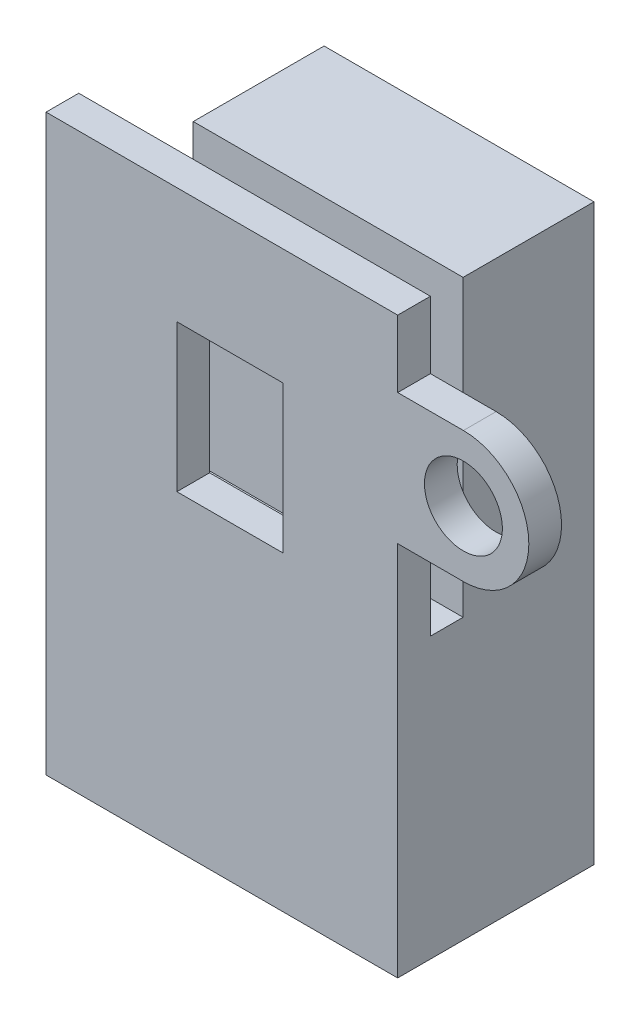
ISO-10303-21;
HEADER;
FILE_DESCRIPTION(('STEP AP214'),'2;1');
FILE_NAME('part.step','',(''),(''),'','','');
FILE_SCHEMA(('AUTOMOTIVE_DESIGN { 1 0 10303 214 1 1 1 1 }'));
ENDSEC;
DATA;
#1=APPLICATION_CONTEXT('core data for automotive mechanical design processes');
#2=APPLICATION_PROTOCOL_DEFINITION('international standard','automotive_design',2000,#1);
#3=PRODUCT_CONTEXT('',#1,'mechanical');
#4=PRODUCT('Part','Part','',(#3));
#5=PRODUCT_RELATED_PRODUCT_CATEGORY('part','',(#4));
#6=PRODUCT_DEFINITION_FORMATION('','',#4);
#7=PRODUCT_DEFINITION_CONTEXT('part definition',#1,'design');
#8=PRODUCT_DEFINITION('design','',#6,#7);
#9=PRODUCT_DEFINITION_SHAPE('','',#8);
#10=(LENGTH_UNIT() NAMED_UNIT(*) SI_UNIT(.MILLI.,.METRE.));
#11=(NAMED_UNIT(*) PLANE_ANGLE_UNIT() SI_UNIT($,.RADIAN.));
#12=(NAMED_UNIT(*) SI_UNIT($,.STERADIAN.) SOLID_ANGLE_UNIT());
#13=UNCERTAINTY_MEASURE_WITH_UNIT(LENGTH_MEASURE(1.E-05),#10,'distance_accuracy_value','');
#14=(GEOMETRIC_REPRESENTATION_CONTEXT(3) GLOBAL_UNCERTAINTY_ASSIGNED_CONTEXT((#13)) GLOBAL_UNIT_ASSIGNED_CONTEXT((#10,
#11,#12)) REPRESENTATION_CONTEXT('',''));
#15=CARTESIAN_POINT('',(0.,0.,0.));
#16=DIRECTION('',(0.,0.,1.));
#17=DIRECTION('',(1.,0.,0.));
#18=AXIS2_PLACEMENT_3D('',#15,#16,#17);
#19=CARTESIAN_POINT('',(0.,0.,0.));
#20=DIRECTION('',(1.,0.,0.));
#21=DIRECTION('',(0.,0.,-1.));
#22=AXIS2_PLACEMENT_3D('',#19,#20,#21);
#23=PLANE('',#22);
#24=DIRECTION('',(0.,-1.,0.));
#25=VECTOR('',#24,1.);
#26=CARTESIAN_POINT('',(0.,37.1,-2.));
#27=LINE('',#26,#25);
#28=CARTESIAN_POINT('',(0.,19.1,-2.));
#29=VERTEX_POINT('',#28);
#30=CARTESIAN_POINT('',(0.,2.,-2.));
#31=VERTEX_POINT('',#30);
#32=EDGE_CURVE('E11',#29,#31,#27,.T.);
#33=ORIENTED_EDGE('',*,*,#32,.F.);
#34=DIRECTION('',(0.,0.,1.));
#35=VECTOR('',#34,1.);
#36=CARTESIAN_POINT('',(0.,19.1,0.));
#37=LINE('',#36,#35);
#38=CARTESIAN_POINT('',(0.,19.1,-4.));
#39=VERTEX_POINT('',#38);
#40=EDGE_CURVE('E209',#39,#29,#37,.T.);
#41=ORIENTED_EDGE('',*,*,#40,.F.);
#42=DIRECTION('',(0.,1.,0.));
#43=VECTOR('',#42,1.);
#44=CARTESIAN_POINT('',(0.,19.1,-4.));
#45=LINE('',#44,#43);
#46=CARTESIAN_POINT('',(0.,37.1,-4.));
#47=VERTEX_POINT('',#46);
#48=EDGE_CURVE('E223',#39,#47,#45,.T.);
#49=ORIENTED_EDGE('',*,*,#48,.T.);
#50=DIRECTION('',(0.,0.,-1.));
#51=VECTOR('',#50,1.);
#52=CARTESIAN_POINT('',(0.,37.1,0.));
#53=LINE('',#52,#51);
#54=CARTESIAN_POINT('',(0.,37.1,-12.));
#55=VERTEX_POINT('',#54);
#56=EDGE_CURVE('E280',#47,#55,#53,.T.);
#57=ORIENTED_EDGE('',*,*,#56,.T.);
#58=DIRECTION('',(0.,1.,0.));
#59=VECTOR('',#58,1.);
#60=CARTESIAN_POINT('',(0.,0.,-12.));
#61=LINE('',#60,#59);
#62=CARTESIAN_POINT('',(0.,2.,-12.));
#63=VERTEX_POINT('',#62);
#64=EDGE_CURVE('E345',#63,#55,#61,.T.);
#65=ORIENTED_EDGE('',*,*,#64,.F.);
#66=DIRECTION('',(0.,0.,1.));
#67=VECTOR('',#66,1.);
#68=CARTESIAN_POINT('',(0.,2.,-12.));
#69=LINE('',#68,#67);
#70=EDGE_CURVE('E334',#63,#31,#69,.T.);
#71=ORIENTED_EDGE('',*,*,#70,.T.);
#72=EDGE_LOOP('',(#33,#41,#49,#57,#65,#71));
#73=FACE_BOUND('',#72,.T.);
#74=ADVANCED_FACE('F41',(#73),#23,.F.);
#75=CARTESIAN_POINT('',(16.5,0.,0.));
#76=DIRECTION('',(1.,0.,0.));
#77=DIRECTION('',(0.,0.,-1.));
#78=AXIS2_PLACEMENT_3D('',#75,#76,#77);
#79=PLANE('',#78);
#80=DIRECTION('',(0.,1.,0.));
#81=VECTOR('',#80,1.);
#82=CARTESIAN_POINT('',(16.5,19.1,-2.));
#83=LINE('',#82,#81);
#84=CARTESIAN_POINT('',(16.5,33.,-2.));
#85=VERTEX_POINT('',#84);
#86=CARTESIAN_POINT('',(16.5,37.1,-2.));
#87=VERTEX_POINT('',#86);
#88=EDGE_CURVE('E222',#85,#87,#83,.T.);
#89=ORIENTED_EDGE('',*,*,#88,.T.);
#90=DIRECTION('',(0.,0.,-1.));
#91=VECTOR('',#90,1.);
#92=CARTESIAN_POINT('',(16.5,37.1,0.));
#93=LINE('',#92,#91);
#94=CARTESIAN_POINT('',(16.5,37.1,0.));
#95=VERTEX_POINT('',#94);
#96=EDGE_CURVE('E170',#95,#87,#93,.T.);
#97=ORIENTED_EDGE('',*,*,#96,.F.);
#98=DIRECTION('',(0.,-1.,0.));
#99=VECTOR('',#98,1.);
#100=CARTESIAN_POINT('',(16.5,0.,0.));
#101=LINE('',#100,#99);
#102=CARTESIAN_POINT('',(16.5,33.,0.));
#103=VERTEX_POINT('',#102);
#104=EDGE_CURVE('E353',#95,#103,#101,.T.);
#105=ORIENTED_EDGE('',*,*,#104,.T.);
#106=DIRECTION('',(0.,0.,1.));
#107=VECTOR('',#106,1.);
#108=CARTESIAN_POINT('',(16.5,33.,-2.));
#109=LINE('',#108,#107);
#110=EDGE_CURVE('E329',#85,#103,#109,.T.);
#111=ORIENTED_EDGE('',*,*,#110,.F.);
#112=EDGE_LOOP('',(#89,#97,#105,#111));
#113=FACE_BOUND('',#112,.T.);
#114=ADVANCED_FACE('F374',(#113),#79,.T.);
#115=CARTESIAN_POINT('',(0.,37.1,0.));
#116=DIRECTION('',(0.,-1.,0.));
#117=DIRECTION('',(0.,0.,-1.));
#118=AXIS2_PLACEMENT_3D('',#115,#116,#117);
#119=PLANE('',#118);
#120=ORIENTED_EDGE('',*,*,#96,.T.);
#121=DIRECTION('',(1.,0.,0.));
#122=VECTOR('',#121,1.);
#123=CARTESIAN_POINT('',(0.,37.1,-2.));
#124=LINE('',#123,#122);
#125=CARTESIAN_POINT('',(-5.,37.1,-2.));
#126=VERTEX_POINT('',#125);
#127=EDGE_CURVE('E164',#126,#87,#124,.T.);
#128=ORIENTED_EDGE('',*,*,#127,.F.);
#129=DIRECTION('',(0.,0.,-1.));
#130=VECTOR('',#129,1.);
#131=CARTESIAN_POINT('',(-5.,37.1,0.));
#132=LINE('',#131,#130);
#133=CARTESIAN_POINT('',(-5.,37.1,0.));
#134=VERTEX_POINT('',#133);
#135=EDGE_CURVE('E168',#134,#126,#132,.T.);
#136=ORIENTED_EDGE('',*,*,#135,.F.);
#137=DIRECTION('',(-1.,0.,0.));
#138=VECTOR('',#137,1.);
#139=CARTESIAN_POINT('',(16.5,37.1,0.));
#140=LINE('',#139,#138);
#141=EDGE_CURVE('E45',#95,#134,#140,.T.);
#142=ORIENTED_EDGE('',*,*,#141,.F.);
#143=EDGE_LOOP('',(#120,#128,#136,#142));
#144=FACE_BOUND('',#143,.T.);
#145=ADVANCED_FACE('F166',(#144),#119,.F.);
#146=CARTESIAN_POINT('',(16.5,0.,0.));
#147=DIRECTION('',(0.,0.,-1.));
#148=DIRECTION('',(-1.,0.,0.));
#149=AXIS2_PLACEMENT_3D('',#146,#147,#148);
#150=PLANE('',#149);
#151=ORIENTED_EDGE('',*,*,#141,.T.);
#152=DIRECTION('',(0.,1.,0.));
#153=VECTOR('',#152,1.);
#154=CARTESIAN_POINT('',(-5.,2.,0.));
#155=LINE('',#154,#153);
#156=CARTESIAN_POINT('',(-5.,2.,0.));
#157=VERTEX_POINT('',#156);
#158=EDGE_CURVE('E192',#157,#134,#155,.T.);
#159=ORIENTED_EDGE('',*,*,#158,.F.);
#160=DIRECTION('',(1.,0.,0.));
#161=VECTOR('',#160,1.);
#162=CARTESIAN_POINT('',(0.,2.,0.));
#163=LINE('',#162,#161);
#164=CARTESIAN_POINT('',(16.5,2.,0.));
#165=VERTEX_POINT('',#164);
#166=EDGE_CURVE('E341',#157,#165,#163,.T.);
#167=ORIENTED_EDGE('',*,*,#166,.T.);
#168=CARTESIAN_POINT('',(16.5,25.,0.));
#169=VERTEX_POINT('',#168);
#170=EDGE_CURVE('E352',#169,#165,#101,.T.);
#171=ORIENTED_EDGE('',*,*,#170,.F.);
#172=DIRECTION('',(1.,0.,0.));
#173=VECTOR('',#172,1.);
#174=CARTESIAN_POINT('',(0.,25.,0.));
#175=LINE('',#174,#173);
#176=CARTESIAN_POINT('',(20.5182193377738,25.,0.));
#177=VERTEX_POINT('',#176);
#178=EDGE_CURVE('E302',#169,#177,#175,.T.);
#179=ORIENTED_EDGE('',*,*,#178,.T.);
#180=CARTESIAN_POINT('',(20.5182193377738,29.,0.));
#181=DIRECTION('',(0.,0.,1.));
#182=DIRECTION('',(1.,0.,0.));
#183=AXIS2_PLACEMENT_3D('',#180,#181,#182);
#184=CIRCLE('',#183,4.);
#185=CARTESIAN_POINT('',(20.5182193377738,33.,0.));
#186=VERTEX_POINT('',#185);
#187=EDGE_CURVE('E297',#186,#177,#184,.F.);
#188=ORIENTED_EDGE('',*,*,#187,.F.);
#189=DIRECTION('',(-1.,0.,0.));
#190=VECTOR('',#189,1.);
#191=CARTESIAN_POINT('',(0.,33.,0.));
#192=LINE('',#191,#190);
#193=EDGE_CURVE('E314',#186,#103,#192,.T.);
#194=ORIENTED_EDGE('',*,*,#193,.T.);
#195=ORIENTED_EDGE('',*,*,#104,.F.);
#196=EDGE_LOOP('',(#151,#159,#167,#171,#179,#188,#194,#195));
#197=FACE_BOUND('',#196,.T.);
#198=CARTESIAN_POINT('',(20.5182193377738,29.,0.));
#199=DIRECTION('',(0.,0.,-1.));
#200=DIRECTION('',(-1.,0.,0.));
#201=AXIS2_PLACEMENT_3D('',#198,#199,#200);
#202=CIRCLE('',#201,2.38125);
#203=CARTESIAN_POINT('',(18.1369693377738,29.,0.));
#204=VERTEX_POINT('',#203);
#205=EDGE_CURVE('E293',#204,#204,#202,.T.);
#206=ORIENTED_EDGE('',*,*,#205,.T.);
#207=EDGE_LOOP('',(#206));
#208=FACE_BOUND('',#207,.T.);
#209=DIRECTION('',(0.,-1.,0.));
#210=VECTOR('',#209,1.);
#211=CARTESIAN_POINT('',(9.5,30.,0.));
#212=LINE('',#211,#210);
#213=CARTESIAN_POINT('',(9.5,30.,0.));
#214=VERTEX_POINT('',#213);
#215=CARTESIAN_POINT('',(9.5,21.,0.));
#216=VERTEX_POINT('',#215);
#217=EDGE_CURVE('E66',#214,#216,#212,.T.);
#218=ORIENTED_EDGE('',*,*,#217,.T.);
#219=DIRECTION('',(-1.,0.,0.));
#220=VECTOR('',#219,1.);
#221=CARTESIAN_POINT('',(9.5,21.,0.));
#222=LINE('',#221,#220);
#223=CARTESIAN_POINT('',(3.,21.,0.));
#224=VERTEX_POINT('',#223);
#225=EDGE_CURVE('E249',#216,#224,#222,.T.);
#226=ORIENTED_EDGE('',*,*,#225,.T.);
#227=DIRECTION('',(0.,1.,0.));
#228=VECTOR('',#227,1.);
#229=CARTESIAN_POINT('',(3.,21.,0.));
#230=LINE('',#229,#228);
#231=CARTESIAN_POINT('',(3.,30.,0.));
#232=VERTEX_POINT('',#231);
#233=EDGE_CURVE('E253',#224,#232,#230,.T.);
#234=ORIENTED_EDGE('',*,*,#233,.T.);
#235=DIRECTION('',(1.,0.,0.));
#236=VECTOR('',#235,1.);
#237=CARTESIAN_POINT('',(3.,30.,0.));
#238=LINE('',#237,#236);
#239=EDGE_CURVE('E234',#232,#214,#238,.T.);
#240=ORIENTED_EDGE('',*,*,#239,.T.);
#241=EDGE_LOOP('',(#218,#226,#234,#240));
#242=FACE_BOUND('',#241,.T.);
#243=ADVANCED_FACE('F395',(#197,#208,#242),#150,.F.);
#244=CARTESIAN_POINT('',(16.5,0.,-12.));
#245=DIRECTION('',(0.,0.,1.));
#246=DIRECTION('',(1.,0.,0.));
#247=AXIS2_PLACEMENT_3D('',#244,#245,#246);
#248=PLANE('',#247);
#249=ORIENTED_EDGE('',*,*,#64,.T.);
#250=DIRECTION('',(1.,0.,0.));
#251=VECTOR('',#250,1.);
#252=CARTESIAN_POINT('',(0.,37.1,-12.));
#253=LINE('',#252,#251);
#254=CARTESIAN_POINT('',(16.5,37.1,-12.));
#255=VERTEX_POINT('',#254);
#256=EDGE_CURVE('E283',#55,#255,#253,.T.);
#257=ORIENTED_EDGE('',*,*,#256,.T.);
#258=DIRECTION('',(0.,1.,0.));
#259=VECTOR('',#258,1.);
#260=CARTESIAN_POINT('',(16.5,0.,-12.));
#261=LINE('',#260,#259);
#262=CARTESIAN_POINT('',(16.5,2.,-12.));
#263=VERTEX_POINT('',#262);
#264=EDGE_CURVE('E348',#263,#255,#261,.T.);
#265=ORIENTED_EDGE('',*,*,#264,.F.);
#266=DIRECTION('',(1.,0.,0.));
#267=VECTOR('',#266,1.);
#268=CARTESIAN_POINT('',(0.,2.,-12.));
#269=LINE('',#268,#267);
#270=EDGE_CURVE('E337',#63,#263,#269,.T.);
#271=ORIENTED_EDGE('',*,*,#270,.F.);
#272=EDGE_LOOP('',(#249,#257,#265,#271));
#273=FACE_BOUND('',#272,.T.);
#274=ADVANCED_FACE('F43',(#273),#248,.F.);
#275=CARTESIAN_POINT('',(16.5,19.1,-2.));
#276=VERTEX_POINT('',#275);
#277=CARTESIAN_POINT('',(16.5,25.,-2.));
#278=VERTEX_POINT('',#277);
#279=EDGE_CURVE('E219',#276,#278,#83,.T.);
#280=ORIENTED_EDGE('',*,*,#279,.T.);
#281=DIRECTION('',(0.,0.,1.));
#282=VECTOR('',#281,1.);
#283=CARTESIAN_POINT('',(16.5,25.,-2.));
#284=LINE('',#283,#282);
#285=EDGE_CURVE('E325',#278,#169,#284,.T.);
#286=ORIENTED_EDGE('',*,*,#285,.T.);
#287=ORIENTED_EDGE('',*,*,#170,.T.);
#288=DIRECTION('',(0.,0.,1.));
#289=VECTOR('',#288,1.);
#290=CARTESIAN_POINT('',(16.5,2.,-12.));
#291=LINE('',#290,#289);
#292=EDGE_CURVE('E324',#263,#165,#291,.T.);
#293=ORIENTED_EDGE('',*,*,#292,.F.);
#294=ORIENTED_EDGE('',*,*,#264,.T.);
#295=CARTESIAN_POINT('',(16.5,37.1,-4.));
#296=VERTEX_POINT('',#295);
#297=EDGE_CURVE('E276',#296,#255,#93,.T.);
#298=ORIENTED_EDGE('',*,*,#297,.F.);
#299=DIRECTION('',(0.,1.,0.));
#300=VECTOR('',#299,1.);
#301=CARTESIAN_POINT('',(16.5,19.1,-4.));
#302=LINE('',#301,#300);
#303=CARTESIAN_POINT('',(16.5,19.1,-4.));
#304=VERTEX_POINT('',#303);
#305=EDGE_CURVE('E58',#304,#296,#302,.T.);
#306=ORIENTED_EDGE('',*,*,#305,.F.);
#307=DIRECTION('',(0.,0.,-1.));
#308=VECTOR('',#307,1.);
#309=CARTESIAN_POINT('',(16.5,19.1,0.));
#310=LINE('',#309,#308);
#311=EDGE_CURVE('E174',#276,#304,#310,.T.);
#312=ORIENTED_EDGE('',*,*,#311,.F.);
#313=EDGE_LOOP('',(#280,#286,#287,#293,#294,#298,#306,#312));
#314=FACE_BOUND('',#313,.T.);
#315=ADVANCED_FACE('F391',(#314),#79,.T.);
#316=CARTESIAN_POINT('',(0.,2.,-12.));
#317=DIRECTION('',(0.,1.,0.));
#318=DIRECTION('',(0.,0.,1.));
#319=AXIS2_PLACEMENT_3D('',#316,#317,#318);
#320=PLANE('',#319);
#321=CARTESIAN_POINT('',(8.25,2.,-6.));
#322=DIRECTION('',(0.,-1.,0.));
#323=DIRECTION('',(0.,0.,-1.));
#324=AXIS2_PLACEMENT_3D('',#321,#322,#323);
#325=CIRCLE('',#324,2.38125);
#326=CARTESIAN_POINT('',(8.25,2.,-8.38125));
#327=VERTEX_POINT('',#326);
#328=EDGE_CURVE('E271',#327,#327,#325,.T.);
#329=ORIENTED_EDGE('',*,*,#328,.F.);
#330=EDGE_LOOP('',(#329));
#331=FACE_BOUND('',#330,.T.);
#332=ORIENTED_EDGE('',*,*,#292,.T.);
#333=ORIENTED_EDGE('',*,*,#166,.F.);
#334=DIRECTION('',(0.,0.,1.));
#335=VECTOR('',#334,1.);
#336=CARTESIAN_POINT('',(-5.,2.,-2.));
#337=LINE('',#336,#335);
#338=CARTESIAN_POINT('',(-5.,2.,-2.));
#339=VERTEX_POINT('',#338);
#340=EDGE_CURVE('E187',#339,#157,#337,.T.);
#341=ORIENTED_EDGE('',*,*,#340,.F.);
#342=DIRECTION('',(1.,0.,0.));
#343=VECTOR('',#342,1.);
#344=CARTESIAN_POINT('',(-5.,2.,-2.));
#345=LINE('',#344,#343);
#346=EDGE_CURVE('E182',#339,#31,#345,.T.);
#347=ORIENTED_EDGE('',*,*,#346,.T.);
#348=ORIENTED_EDGE('',*,*,#70,.F.);
#349=ORIENTED_EDGE('',*,*,#270,.T.);
#350=EDGE_LOOP('',(#332,#333,#341,#347,#348,#349));
#351=FACE_BOUND('',#350,.T.);
#352=ADVANCED_FACE('F400',(#331,#351),#320,.F.);
#353=CARTESIAN_POINT('',(20.5182193377738,29.,-2.));
#354=DIRECTION('',(0.,0.,1.));
#355=DIRECTION('',(1.,0.,0.));
#356=AXIS2_PLACEMENT_3D('',#353,#354,#355);
#357=CYLINDRICAL_SURFACE('',#356,4.);
#358=ORIENTED_EDGE('',*,*,#187,.T.);
#359=DIRECTION('',(0.,0.,1.));
#360=VECTOR('',#359,1.);
#361=CARTESIAN_POINT('',(20.5182193377738,25.,-2.));
#362=LINE('',#361,#360);
#363=CARTESIAN_POINT('',(20.5182193377738,25.,-2.));
#364=VERTEX_POINT('',#363);
#365=EDGE_CURVE('E321',#364,#177,#362,.T.);
#366=ORIENTED_EDGE('',*,*,#365,.F.);
#367=CARTESIAN_POINT('',(20.5182193377738,29.,-2.));
#368=DIRECTION('',(0.,0.,1.));
#369=DIRECTION('',(1.,0.,0.));
#370=AXIS2_PLACEMENT_3D('',#367,#368,#369);
#371=CIRCLE('',#370,4.);
#372=CARTESIAN_POINT('',(20.5182193377738,33.,-2.));
#373=VERTEX_POINT('',#372);
#374=EDGE_CURVE('E298',#373,#364,#371,.F.);
#375=ORIENTED_EDGE('',*,*,#374,.F.);
#376=DIRECTION('',(0.,0.,1.));
#377=VECTOR('',#376,1.);
#378=CARTESIAN_POINT('',(20.5182193377738,33.,-2.));
#379=LINE('',#378,#377);
#380=EDGE_CURVE('E310',#373,#186,#379,.T.);
#381=ORIENTED_EDGE('',*,*,#380,.T.);
#382=EDGE_LOOP('',(#358,#366,#375,#381));
#383=FACE_BOUND('',#382,.T.);
#384=ADVANCED_FACE('F384',(#383),#357,.T.);
#385=CARTESIAN_POINT('',(0.,25.,-2.));
#386=DIRECTION('',(0.,-1.,0.));
#387=DIRECTION('',(1.,0.,0.));
#388=AXIS2_PLACEMENT_3D('',#385,#386,#387);
#389=PLANE('',#388);
#390=ORIENTED_EDGE('',*,*,#178,.F.);
#391=ORIENTED_EDGE('',*,*,#285,.F.);
#392=DIRECTION('',(1.,0.,0.));
#393=VECTOR('',#392,1.);
#394=CARTESIAN_POINT('',(0.,25.,-2.));
#395=LINE('',#394,#393);
#396=EDGE_CURVE('E306',#278,#364,#395,.T.);
#397=ORIENTED_EDGE('',*,*,#396,.T.);
#398=ORIENTED_EDGE('',*,*,#365,.T.);
#399=EDGE_LOOP('',(#390,#391,#397,#398));
#400=FACE_BOUND('',#399,.T.);
#401=ADVANCED_FACE('F389',(#400),#389,.T.);
#402=CARTESIAN_POINT('',(0.,33.,-2.));
#403=DIRECTION('',(0.,1.,0.));
#404=DIRECTION('',(0.,0.,1.));
#405=AXIS2_PLACEMENT_3D('',#402,#403,#404);
#406=PLANE('',#405);
#407=ORIENTED_EDGE('',*,*,#193,.F.);
#408=ORIENTED_EDGE('',*,*,#380,.F.);
#409=DIRECTION('',(-1.,0.,0.));
#410=VECTOR('',#409,1.);
#411=CARTESIAN_POINT('',(0.,33.,-2.));
#412=LINE('',#411,#410);
#413=EDGE_CURVE('E301',#373,#85,#412,.T.);
#414=ORIENTED_EDGE('',*,*,#413,.T.);
#415=ORIENTED_EDGE('',*,*,#110,.T.);
#416=EDGE_LOOP('',(#407,#408,#414,#415));
#417=FACE_BOUND('',#416,.T.);
#418=ADVANCED_FACE('F379',(#417),#406,.T.);
#419=CARTESIAN_POINT('',(0.,0.,-2.));
#420=DIRECTION('',(0.,0.,1.));
#421=DIRECTION('',(1.,0.,0.));
#422=AXIS2_PLACEMENT_3D('',#419,#420,#421);
#423=PLANE('',#422);
#424=CARTESIAN_POINT('',(20.5182193377738,29.,-2.));
#425=DIRECTION('',(0.,0.,-1.));
#426=DIRECTION('',(-1.,0.,0.));
#427=AXIS2_PLACEMENT_3D('',#424,#425,#426);
#428=CIRCLE('',#427,2.38125);
#429=CARTESIAN_POINT('',(18.1369693377738,29.,-2.));
#430=VERTEX_POINT('',#429);
#431=EDGE_CURVE('E289',#430,#430,#428,.T.);
#432=ORIENTED_EDGE('',*,*,#431,.F.);
#433=EDGE_LOOP('',(#432));
#434=FACE_BOUND('',#433,.T.);
#435=ORIENTED_EDGE('',*,*,#374,.T.);
#436=ORIENTED_EDGE('',*,*,#396,.F.);
#437=ORIENTED_EDGE('',*,*,#279,.F.);
#438=DIRECTION('',(1.,0.,0.));
#439=VECTOR('',#438,1.);
#440=CARTESIAN_POINT('',(0.,19.1,-2.));
#441=LINE('',#440,#439);
#442=EDGE_CURVE('E213',#29,#276,#441,.T.);
#443=ORIENTED_EDGE('',*,*,#442,.F.);
#444=ORIENTED_EDGE('',*,*,#32,.T.);
#445=ORIENTED_EDGE('',*,*,#346,.F.);
#446=DIRECTION('',(0.,-1.,0.));
#447=VECTOR('',#446,1.);
#448=CARTESIAN_POINT('',(-5.,37.1,-2.));
#449=LINE('',#448,#447);
#450=EDGE_CURVE('E178',#126,#339,#449,.T.);
#451=ORIENTED_EDGE('',*,*,#450,.F.);
#452=ORIENTED_EDGE('',*,*,#127,.T.);
#453=ORIENTED_EDGE('',*,*,#88,.F.);
#454=ORIENTED_EDGE('',*,*,#413,.F.);
#455=EDGE_LOOP('',(#435,#436,#437,#443,#444,#445,#451,#452,#453,#454));
#456=FACE_BOUND('',#455,.T.);
#457=DIRECTION('',(1.,0.,0.));
#458=VECTOR('',#457,1.);
#459=CARTESIAN_POINT('',(3.,30.,-2.));
#460=LINE('',#459,#458);
#461=CARTESIAN_POINT('',(3.,30.,-2.));
#462=VERTEX_POINT('',#461);
#463=CARTESIAN_POINT('',(9.5,30.,-2.));
#464=VERTEX_POINT('',#463);
#465=EDGE_CURVE('E242',#462,#464,#460,.T.);
#466=ORIENTED_EDGE('',*,*,#465,.F.);
#467=DIRECTION('',(0.,1.,0.));
#468=VECTOR('',#467,1.);
#469=CARTESIAN_POINT('',(3.,21.,-2.));
#470=LINE('',#469,#468);
#471=CARTESIAN_POINT('',(3.,21.,-2.));
#472=VERTEX_POINT('',#471);
#473=EDGE_CURVE('E238',#472,#462,#470,.T.);
#474=ORIENTED_EDGE('',*,*,#473,.F.);
#475=DIRECTION('',(-1.,0.,0.));
#476=VECTOR('',#475,1.);
#477=CARTESIAN_POINT('',(9.5,21.,-2.));
#478=LINE('',#477,#476);
#479=CARTESIAN_POINT('',(9.5,21.,-2.));
#480=VERTEX_POINT('',#479);
#481=EDGE_CURVE('E233',#480,#472,#478,.T.);
#482=ORIENTED_EDGE('',*,*,#481,.F.);
#483=DIRECTION('',(0.,-1.,0.));
#484=VECTOR('',#483,1.);
#485=CARTESIAN_POINT('',(9.5,30.,-2.));
#486=LINE('',#485,#484);
#487=EDGE_CURVE('E229',#464,#480,#486,.T.);
#488=ORIENTED_EDGE('',*,*,#487,.F.);
#489=EDGE_LOOP('',(#466,#474,#482,#488));
#490=FACE_BOUND('',#489,.T.);
#491=ADVANCED_FACE('F179',(#434,#456,#490),#423,.F.);
#492=CARTESIAN_POINT('',(20.5182193377738,29.,10.6066017177982));
#493=DIRECTION('',(0.,0.,-1.));
#494=DIRECTION('',(-1.,0.,0.));
#495=AXIS2_PLACEMENT_3D('',#492,#493,#494);
#496=CYLINDRICAL_SURFACE('',#495,2.38125);
#497=ORIENTED_EDGE('',*,*,#431,.T.);
#498=EDGE_LOOP('',(#497));
#499=FACE_BOUND('',#498,.T.);
#500=ORIENTED_EDGE('',*,*,#205,.F.);
#501=EDGE_LOOP('',(#500));
#502=FACE_BOUND('',#501,.T.);
#503=ADVANCED_FACE('F428',(#499,#502),#496,.F.);
#504=ORIENTED_EDGE('',*,*,#56,.F.);
#505=DIRECTION('',(-1.,0.,0.));
#506=VECTOR('',#505,1.);
#507=CARTESIAN_POINT('',(0.,37.1,-4.));
#508=LINE('',#507,#506);
#509=EDGE_CURVE('E175',#296,#47,#508,.T.);
#510=ORIENTED_EDGE('',*,*,#509,.F.);
#511=ORIENTED_EDGE('',*,*,#297,.T.);
#512=ORIENTED_EDGE('',*,*,#256,.F.);
#513=EDGE_LOOP('',(#504,#510,#511,#512));
#514=FACE_BOUND('',#513,.T.);
#515=ADVANCED_FACE('F367',(#514),#119,.F.);
#516=CARTESIAN_POINT('',(8.25,8.35,-6.));
#517=DIRECTION('',(0.,-1.,0.));
#518=DIRECTION('',(0.,0.,-1.));
#519=AXIS2_PLACEMENT_3D('',#516,#517,#518);
#520=CYLINDRICAL_SURFACE('',#519,2.38125);
#521=CARTESIAN_POINT('',(8.25,8.35,-6.));
#522=DIRECTION('',(0.,-1.,0.));
#523=DIRECTION('',(0.,0.,-1.));
#524=AXIS2_PLACEMENT_3D('',#521,#522,#523);
#525=CIRCLE('',#524,2.38125);
#526=CARTESIAN_POINT('',(8.25,8.35,-8.38125));
#527=VERTEX_POINT('',#526);
#528=EDGE_CURVE('E272',#527,#527,#525,.T.);
#529=ORIENTED_EDGE('',*,*,#528,.F.);
#530=EDGE_LOOP('',(#529));
#531=FACE_BOUND('',#530,.T.);
#532=ORIENTED_EDGE('',*,*,#328,.T.);
#533=EDGE_LOOP('',(#532));
#534=FACE_BOUND('',#533,.T.);
#535=ADVANCED_FACE('F427',(#531,#534),#520,.F.);
#536=CARTESIAN_POINT('',(0.,8.35,0.));
#537=DIRECTION('',(0.,-1.,0.));
#538=DIRECTION('',(0.,0.,-1.));
#539=AXIS2_PLACEMENT_3D('',#536,#537,#538);
#540=PLANE('',#539);
#541=ORIENTED_EDGE('',*,*,#528,.T.);
#542=EDGE_LOOP('',(#541));
#543=FACE_BOUND('',#542,.T.);
#544=ADVANCED_FACE('F433',(#543),#540,.T.);
#545=CARTESIAN_POINT('',(9.5,30.,-2.));
#546=DIRECTION('',(-1.,0.,0.));
#547=DIRECTION('',(0.,0.,1.));
#548=AXIS2_PLACEMENT_3D('',#545,#546,#547);
#549=PLANE('',#548);
#550=ORIENTED_EDGE('',*,*,#217,.F.);
#551=DIRECTION('',(0.,0.,1.));
#552=VECTOR('',#551,1.);
#553=CARTESIAN_POINT('',(9.5,30.,-2.));
#554=LINE('',#553,#552);
#555=EDGE_CURVE('E246',#464,#214,#554,.T.);
#556=ORIENTED_EDGE('',*,*,#555,.F.);
#557=ORIENTED_EDGE('',*,*,#487,.T.);
#558=DIRECTION('',(0.,0.,1.));
#559=VECTOR('',#558,1.);
#560=CARTESIAN_POINT('',(9.5,21.,-2.));
#561=LINE('',#560,#559);
#562=EDGE_CURVE('E268',#480,#216,#561,.T.);
#563=ORIENTED_EDGE('',*,*,#562,.T.);
#564=EDGE_LOOP('',(#550,#556,#557,#563));
#565=FACE_BOUND('',#564,.T.);
#566=ADVANCED_FACE('F496',(#565),#549,.T.);
#567=CARTESIAN_POINT('',(9.5,21.,-2.));
#568=DIRECTION('',(0.,1.,0.));
#569=DIRECTION('',(0.,0.,1.));
#570=AXIS2_PLACEMENT_3D('',#567,#568,#569);
#571=PLANE('',#570);
#572=ORIENTED_EDGE('',*,*,#225,.F.);
#573=ORIENTED_EDGE('',*,*,#562,.F.);
#574=ORIENTED_EDGE('',*,*,#481,.T.);
#575=DIRECTION('',(0.,0.,1.));
#576=VECTOR('',#575,1.);
#577=CARTESIAN_POINT('',(3.,21.,-2.));
#578=LINE('',#577,#576);
#579=EDGE_CURVE('E265',#472,#224,#578,.T.);
#580=ORIENTED_EDGE('',*,*,#579,.T.);
#581=EDGE_LOOP('',(#572,#573,#574,#580));
#582=FACE_BOUND('',#581,.T.);
#583=ADVANCED_FACE('F492',(#582),#571,.T.);
#584=CARTESIAN_POINT('',(3.,21.,-2.));
#585=DIRECTION('',(1.,0.,0.));
#586=DIRECTION('',(0.,0.,-1.));
#587=AXIS2_PLACEMENT_3D('',#584,#585,#586);
#588=PLANE('',#587);
#589=ORIENTED_EDGE('',*,*,#233,.F.);
#590=ORIENTED_EDGE('',*,*,#579,.F.);
#591=ORIENTED_EDGE('',*,*,#473,.T.);
#592=DIRECTION('',(0.,0.,1.));
#593=VECTOR('',#592,1.);
#594=CARTESIAN_POINT('',(3.,30.,-2.));
#595=LINE('',#594,#593);
#596=EDGE_CURVE('E262',#462,#232,#595,.T.);
#597=ORIENTED_EDGE('',*,*,#596,.T.);
#598=EDGE_LOOP('',(#589,#590,#591,#597));
#599=FACE_BOUND('',#598,.T.);
#600=ADVANCED_FACE('F488',(#599),#588,.T.);
#601=CARTESIAN_POINT('',(3.,30.,-2.));
#602=DIRECTION('',(0.,-1.,0.));
#603=DIRECTION('',(0.,0.,-1.));
#604=AXIS2_PLACEMENT_3D('',#601,#602,#603);
#605=PLANE('',#604);
#606=ORIENTED_EDGE('',*,*,#239,.F.);
#607=ORIENTED_EDGE('',*,*,#596,.F.);
#608=ORIENTED_EDGE('',*,*,#465,.T.);
#609=ORIENTED_EDGE('',*,*,#555,.T.);
#610=EDGE_LOOP('',(#606,#607,#608,#609));
#611=FACE_BOUND('',#610,.T.);
#612=ADVANCED_FACE('F485',(#611),#605,.T.);
#613=CARTESIAN_POINT('',(0.,19.1,-4.));
#614=DIRECTION('',(0.,0.,-1.));
#615=DIRECTION('',(-1.,0.,0.));
#616=AXIS2_PLACEMENT_3D('',#613,#614,#615);
#617=PLANE('',#616);
#618=ORIENTED_EDGE('',*,*,#509,.T.);
#619=ORIENTED_EDGE('',*,*,#48,.F.);
#620=DIRECTION('',(-1.,0.,0.));
#621=VECTOR('',#620,1.);
#622=CARTESIAN_POINT('',(0.,19.1,-4.));
#623=LINE('',#622,#621);
#624=EDGE_CURVE('E205',#304,#39,#623,.T.);
#625=ORIENTED_EDGE('',*,*,#624,.F.);
#626=ORIENTED_EDGE('',*,*,#305,.T.);
#627=EDGE_LOOP('',(#618,#619,#625,#626));
#628=FACE_BOUND('',#627,.T.);
#629=ADVANCED_FACE('F468',(#628),#617,.F.);
#630=CARTESIAN_POINT('',(0.,19.1,0.));
#631=DIRECTION('',(0.,1.,0.));
#632=DIRECTION('',(0.,0.,1.));
#633=AXIS2_PLACEMENT_3D('',#630,#631,#632);
#634=PLANE('',#633);
#635=ORIENTED_EDGE('',*,*,#311,.T.);
#636=ORIENTED_EDGE('',*,*,#624,.T.);
#637=ORIENTED_EDGE('',*,*,#40,.T.);
#638=ORIENTED_EDGE('',*,*,#442,.T.);
#639=EDGE_LOOP('',(#635,#636,#637,#638));
#640=FACE_BOUND('',#639,.T.);
#641=ADVANCED_FACE('F463',(#640),#634,.T.);
#642=CARTESIAN_POINT('',(-5.,0.,0.));
#643=DIRECTION('',(-1.,0.,0.));
#644=DIRECTION('',(0.,0.,1.));
#645=AXIS2_PLACEMENT_3D('',#642,#643,#644);
#646=PLANE('',#645);
#647=ORIENTED_EDGE('',*,*,#135,.T.);
#648=ORIENTED_EDGE('',*,*,#450,.T.);
#649=ORIENTED_EDGE('',*,*,#340,.T.);
#650=ORIENTED_EDGE('',*,*,#158,.T.);
#651=EDGE_LOOP('',(#647,#648,#649,#650));
#652=FACE_BOUND('',#651,.T.);
#653=ADVANCED_FACE('F190',(#652),#646,.T.);
#654=CLOSED_SHELL('',(#74,#114,#145,#243,#274,#315,#352,#384,#401,#418,#491,#503,#515,#535,#544,
#566,#583,#600,#612,#629,#641,#653));
#655=MANIFOLD_SOLID_BREP('B2',#654);
#656=ADVANCED_BREP_SHAPE_REPRESENTATION('',(#18,#655),#14);
#657=SHAPE_DEFINITION_REPRESENTATION(#9,#656);
ENDSEC;
END-ISO-10303-21;
